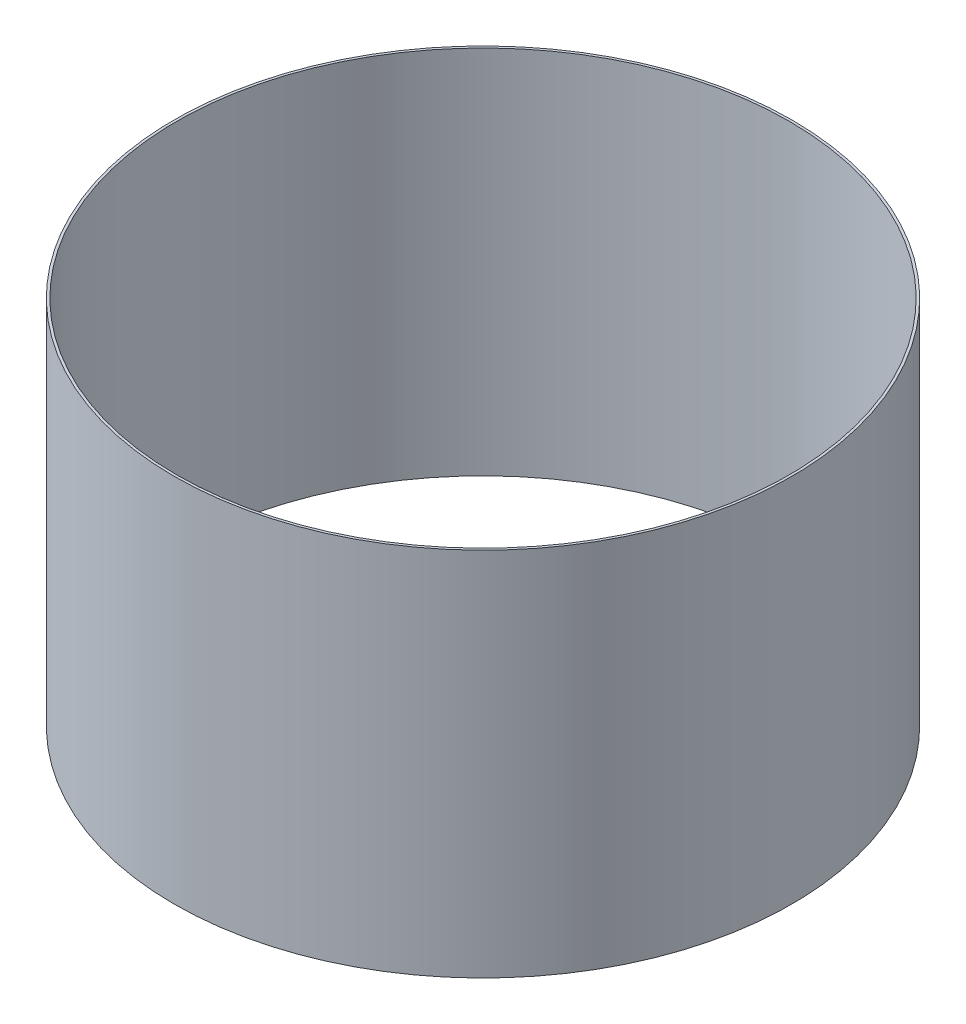
ISO-10303-21;
HEADER;
FILE_DESCRIPTION(('STEP AP214'),'2;1');
FILE_NAME('part.step','',(''),(''),'','','');
FILE_SCHEMA(('AUTOMOTIVE_DESIGN { 1 0 10303 214 1 1 1 1 }'));
ENDSEC;
DATA;
#1=APPLICATION_CONTEXT('core data for automotive mechanical design processes');
#2=APPLICATION_PROTOCOL_DEFINITION('international standard','automotive_design',2000,#1);
#3=PRODUCT_CONTEXT('',#1,'mechanical');
#4=PRODUCT('Part','Part','',(#3));
#5=PRODUCT_RELATED_PRODUCT_CATEGORY('part','',(#4));
#6=PRODUCT_DEFINITION_FORMATION('','',#4);
#7=PRODUCT_DEFINITION_CONTEXT('part definition',#1,'design');
#8=PRODUCT_DEFINITION('design','',#6,#7);
#9=PRODUCT_DEFINITION_SHAPE('','',#8);
#10=(LENGTH_UNIT() NAMED_UNIT(*) SI_UNIT(.MILLI.,.METRE.));
#11=(NAMED_UNIT(*) PLANE_ANGLE_UNIT() SI_UNIT($,.RADIAN.));
#12=(NAMED_UNIT(*) SI_UNIT($,.STERADIAN.) SOLID_ANGLE_UNIT());
#13=UNCERTAINTY_MEASURE_WITH_UNIT(LENGTH_MEASURE(1.E-05),#10,'distance_accuracy_value','');
#14=(GEOMETRIC_REPRESENTATION_CONTEXT(3) GLOBAL_UNCERTAINTY_ASSIGNED_CONTEXT((#13)) GLOBAL_UNIT_ASSIGNED_CONTEXT((#10,
#11,#12)) REPRESENTATION_CONTEXT('',''));
#15=CARTESIAN_POINT('',(0.,0.,0.));
#16=DIRECTION('',(0.,0.,1.));
#17=DIRECTION('',(1.,0.,0.));
#18=AXIS2_PLACEMENT_3D('',#15,#16,#17);
#19=CARTESIAN_POINT('',(0.,0.,0.));
#20=DIRECTION('',(0.,1.,0.));
#21=DIRECTION('',(0.,0.,1.));
#22=AXIS2_PLACEMENT_3D('',#19,#20,#21);
#23=CYLINDRICAL_SURFACE('',#22,250.);
#24=CARTESIAN_POINT('',(0.,0.,0.));
#25=DIRECTION('',(0.,1.,0.));
#26=DIRECTION('',(0.,0.,1.));
#27=AXIS2_PLACEMENT_3D('',#24,#25,#26);
#28=CIRCLE('',#27,250.);
#29=CARTESIAN_POINT('',(0.,0.,250.));
#30=VERTEX_POINT('',#29);
#31=EDGE_CURVE('E10',#30,#30,#28,.T.);
#32=ORIENTED_EDGE('',*,*,#31,.T.);
#33=EDGE_LOOP('',(#32));
#34=FACE_BOUND('',#33,.T.);
#35=CARTESIAN_POINT('',(0.,300.,0.));
#36=DIRECTION('',(0.,1.,0.));
#37=DIRECTION('',(0.,0.,1.));
#38=AXIS2_PLACEMENT_3D('',#35,#36,#37);
#39=CIRCLE('',#38,250.);
#40=CARTESIAN_POINT('',(0.,300.,250.));
#41=VERTEX_POINT('',#40);
#42=EDGE_CURVE('E52',#41,#41,#39,.T.);
#43=ORIENTED_EDGE('',*,*,#42,.F.);
#44=EDGE_LOOP('',(#43));
#45=FACE_BOUND('',#44,.T.);
#46=ADVANCED_FACE('F38',(#34,#45),#23,.T.);
#47=CARTESIAN_POINT('',(-248.,0.,0.));
#48=DIRECTION('',(0.,-1.,0.));
#49=DIRECTION('',(0.,0.,-1.));
#50=AXIS2_PLACEMENT_3D('',#47,#48,#49);
#51=PLANE('',#50);
#52=CARTESIAN_POINT('',(0.,0.,0.));
#53=DIRECTION('',(0.,1.,0.));
#54=DIRECTION('',(0.,0.,1.));
#55=AXIS2_PLACEMENT_3D('',#52,#53,#54);
#56=CIRCLE('',#55,248.);
#57=CARTESIAN_POINT('',(0.,0.,248.));
#58=VERTEX_POINT('',#57);
#59=EDGE_CURVE('E44',#58,#58,#56,.T.);
#60=ORIENTED_EDGE('',*,*,#59,.T.);
#61=EDGE_LOOP('',(#60));
#62=FACE_BOUND('',#61,.T.);
#63=ORIENTED_EDGE('',*,*,#31,.F.);
#64=EDGE_LOOP('',(#63));
#65=FACE_BOUND('',#64,.T.);
#66=ADVANCED_FACE('F62',(#62,#65),#51,.T.);
#67=CARTESIAN_POINT('',(0.,0.,0.));
#68=DIRECTION('',(0.,1.,0.));
#69=DIRECTION('',(0.,0.,1.));
#70=AXIS2_PLACEMENT_3D('',#67,#68,#69);
#71=CYLINDRICAL_SURFACE('',#70,248.);
#72=CARTESIAN_POINT('',(0.,300.,0.));
#73=DIRECTION('',(0.,1.,0.));
#74=DIRECTION('',(0.,0.,1.));
#75=AXIS2_PLACEMENT_3D('',#72,#73,#74);
#76=CIRCLE('',#75,248.);
#77=CARTESIAN_POINT('',(0.,300.,248.));
#78=VERTEX_POINT('',#77);
#79=EDGE_CURVE('E48',#78,#78,#76,.T.);
#80=ORIENTED_EDGE('',*,*,#79,.T.);
#81=EDGE_LOOP('',(#80));
#82=FACE_BOUND('',#81,.T.);
#83=ORIENTED_EDGE('',*,*,#59,.F.);
#84=EDGE_LOOP('',(#83));
#85=FACE_BOUND('',#84,.T.);
#86=ADVANCED_FACE('F66',(#82,#85),#71,.F.);
#87=CARTESIAN_POINT('',(-248.,300.,0.));
#88=DIRECTION('',(0.,1.,0.));
#89=DIRECTION('',(0.,0.,1.));
#90=AXIS2_PLACEMENT_3D('',#87,#88,#89);
#91=PLANE('',#90);
#92=ORIENTED_EDGE('',*,*,#42,.T.);
#93=EDGE_LOOP('',(#92));
#94=FACE_BOUND('',#93,.T.);
#95=ORIENTED_EDGE('',*,*,#79,.F.);
#96=EDGE_LOOP('',(#95));
#97=FACE_BOUND('',#96,.T.);
#98=ADVANCED_FACE('F58',(#94,#97),#91,.T.);
#99=CLOSED_SHELL('',(#46,#66,#86,#98));
#100=MANIFOLD_SOLID_BREP('B2',#99);
#101=ADVANCED_BREP_SHAPE_REPRESENTATION('',(#18,#100),#14);
#102=SHAPE_DEFINITION_REPRESENTATION(#9,#101);
ENDSEC;
END-ISO-10303-21;
